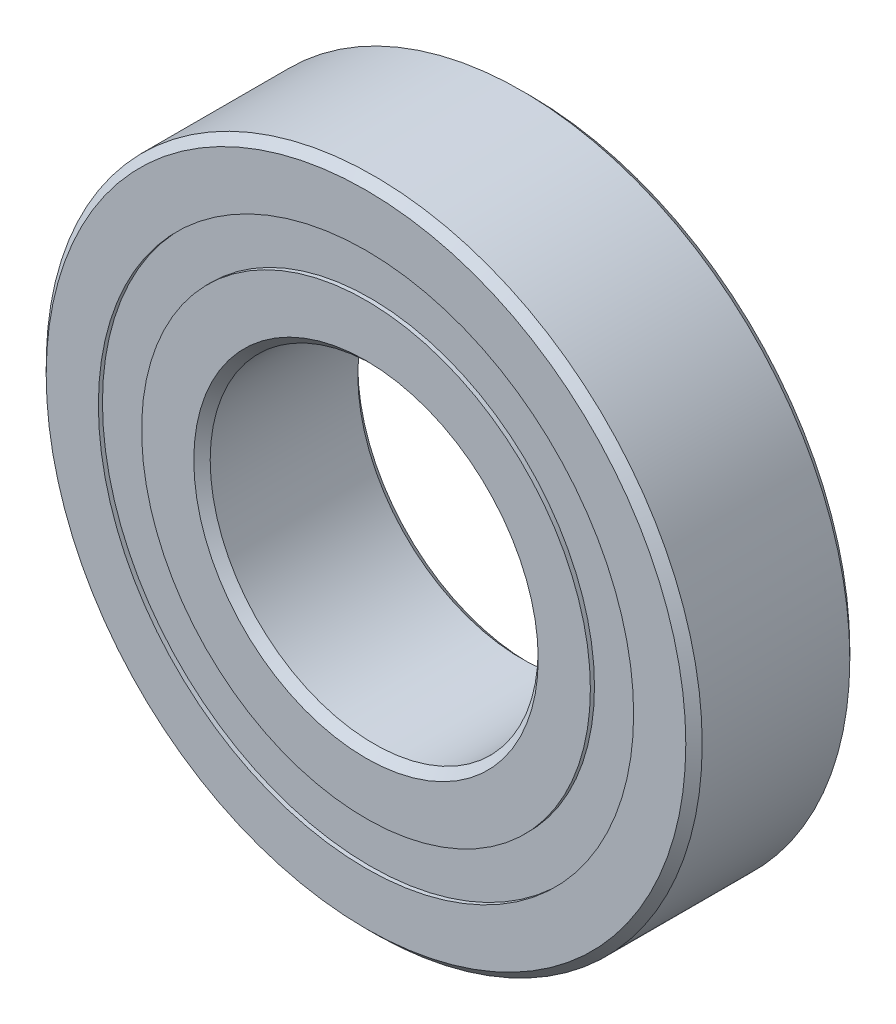
ISO-10303-21;
HEADER;
FILE_DESCRIPTION(('STEP AP214'),'2;1');
FILE_NAME('part.step','',(''),(''),'','','');
FILE_SCHEMA(('AUTOMOTIVE_DESIGN { 1 0 10303 214 1 1 1 1 }'));
ENDSEC;
DATA;
#1=APPLICATION_CONTEXT('core data for automotive mechanical design processes');
#2=APPLICATION_PROTOCOL_DEFINITION('international standard','automotive_design',2000,#1);
#3=PRODUCT_CONTEXT('',#1,'mechanical');
#4=PRODUCT('Part','Part','',(#3));
#5=PRODUCT_RELATED_PRODUCT_CATEGORY('part','',(#4));
#6=PRODUCT_DEFINITION_FORMATION('','',#4);
#7=PRODUCT_DEFINITION_CONTEXT('part definition',#1,'design');
#8=PRODUCT_DEFINITION('design','',#6,#7);
#9=PRODUCT_DEFINITION_SHAPE('','',#8);
#10=(LENGTH_UNIT() NAMED_UNIT(*) SI_UNIT(.MILLI.,.METRE.));
#11=(NAMED_UNIT(*) PLANE_ANGLE_UNIT() SI_UNIT($,.RADIAN.));
#12=(NAMED_UNIT(*) SI_UNIT($,.STERADIAN.) SOLID_ANGLE_UNIT());
#13=UNCERTAINTY_MEASURE_WITH_UNIT(LENGTH_MEASURE(1.E-05),#10,'distance_accuracy_value','');
#14=(GEOMETRIC_REPRESENTATION_CONTEXT(3) GLOBAL_UNCERTAINTY_ASSIGNED_CONTEXT((#13)) GLOBAL_UNIT_ASSIGNED_CONTEXT((#10,
#11,#12)) REPRESENTATION_CONTEXT('',''));
#15=CARTESIAN_POINT('',(0.,0.,0.));
#16=DIRECTION('',(0.,0.,1.));
#17=DIRECTION('',(1.,0.,0.));
#18=AXIS2_PLACEMENT_3D('',#15,#16,#17);
#19=CARTESIAN_POINT('',(0.,20.7247252747253,-6.0325));
#20=DIRECTION('',(0.,0.,1.));
#21=DIRECTION('',(1.,0.,0.));
#22=AXIS2_PLACEMENT_3D('',#19,#20,#21);
#23=PLANE('',#22);
#24=CARTESIAN_POINT('',(0.,0.,-6.0325));
#25=DIRECTION('',(0.,0.,1.));
#26=DIRECTION('',(1.,0.,0.));
#27=AXIS2_PLACEMENT_3D('',#24,#25,#26);
#28=CIRCLE('',#27,20.7247252747253);
#29=CARTESIAN_POINT('',(20.7247252747253,0.,-6.0325));
#30=VERTEX_POINT('',#29);
#31=EDGE_CURVE('E58',#30,#30,#28,.T.);
#32=ORIENTED_EDGE('',*,*,#31,.F.);
#33=EDGE_LOOP('',(#32));
#34=FACE_BOUND('',#33,.T.);
#35=CARTESIAN_POINT('',(0.,0.,-6.0325));
#36=DIRECTION('',(0.,0.,1.));
#37=DIRECTION('',(1.,0.,0.));
#38=AXIS2_PLACEMENT_3D('',#35,#36,#37);
#39=CIRCLE('',#38,17.3752747252747);
#40=CARTESIAN_POINT('',(17.3752747252747,0.,-6.0325));
#41=VERTEX_POINT('',#40);
#42=EDGE_CURVE('E11',#41,#41,#39,.T.);
#43=ORIENTED_EDGE('',*,*,#42,.T.);
#44=EDGE_LOOP('',(#43));
#45=FACE_BOUND('',#44,.T.);
#46=ADVANCED_FACE('F44',(#34,#45),#23,.F.);
#47=CARTESIAN_POINT('',(0.,0.,6.35));
#48=DIRECTION('',(0.,0.,1.));
#49=DIRECTION('',(1.,0.,0.));
#50=AXIS2_PLACEMENT_3D('',#47,#48,#49);
#51=CYLINDRICAL_SURFACE('',#50,17.3752747252747);
#52=ORIENTED_EDGE('',*,*,#42,.F.);
#53=EDGE_LOOP('',(#52));
#54=FACE_BOUND('',#53,.T.);
#55=CARTESIAN_POINT('',(0.,0.,-3.28171342706955));
#56=DIRECTION('',(0.,0.,1.));
#57=DIRECTION('',(1.,0.,0.));
#58=AXIS2_PLACEMENT_3D('',#55,#56,#57);
#59=CIRCLE('',#58,17.3752747252747);
#60=CARTESIAN_POINT('',(17.3752747252747,0.,-3.28171342706955));
#61=VERTEX_POINT('',#60);
#62=EDGE_CURVE('E50',#61,#61,#59,.T.);
#63=ORIENTED_EDGE('',*,*,#62,.T.);
#64=EDGE_LOOP('',(#63));
#65=FACE_BOUND('',#64,.T.);
#66=ADVANCED_FACE('F67',(#54,#65),#51,.F.);
#67=CARTESIAN_POINT('',(0.,20.7247252747253,-3.28171342706955));
#68=DIRECTION('',(0.,0.,-1.));
#69=DIRECTION('',(-1.,0.,0.));
#70=AXIS2_PLACEMENT_3D('',#67,#68,#69);
#71=PLANE('',#70);
#72=ORIENTED_EDGE('',*,*,#62,.F.);
#73=EDGE_LOOP('',(#72));
#74=FACE_BOUND('',#73,.T.);
#75=CARTESIAN_POINT('',(0.,0.,-3.28171342706955));
#76=DIRECTION('',(0.,0.,1.));
#77=DIRECTION('',(1.,0.,0.));
#78=AXIS2_PLACEMENT_3D('',#75,#76,#77);
#79=CIRCLE('',#78,20.7247252747253);
#80=CARTESIAN_POINT('',(20.7247252747253,0.,-3.28171342706955));
#81=VERTEX_POINT('',#80);
#82=EDGE_CURVE('E54',#81,#81,#79,.T.);
#83=ORIENTED_EDGE('',*,*,#82,.T.);
#84=EDGE_LOOP('',(#83));
#85=FACE_BOUND('',#84,.T.);
#86=ADVANCED_FACE('F71',(#74,#85),#71,.F.);
#87=CARTESIAN_POINT('',(0.,0.,6.35));
#88=DIRECTION('',(0.,0.,1.));
#89=DIRECTION('',(1.,0.,0.));
#90=AXIS2_PLACEMENT_3D('',#87,#88,#89);
#91=CYLINDRICAL_SURFACE('',#90,20.7247252747253);
#92=ORIENTED_EDGE('',*,*,#82,.F.);
#93=EDGE_LOOP('',(#92));
#94=FACE_BOUND('',#93,.T.);
#95=ORIENTED_EDGE('',*,*,#31,.T.);
#96=EDGE_LOOP('',(#95));
#97=FACE_BOUND('',#96,.T.);
#98=ADVANCED_FACE('F64',(#94,#97),#91,.T.);
#99=CLOSED_SHELL('',(#46,#66,#86,#98));
#100=MANIFOLD_SOLID_BREP('B2',#99);
#101=CARTESIAN_POINT('',(0.,20.7247252747253,6.0325));
#102=DIRECTION('',(0.,0.,-1.));
#103=DIRECTION('',(-1.,0.,0.));
#104=AXIS2_PLACEMENT_3D('',#101,#102,#103);
#105=PLANE('',#104);
#106=CARTESIAN_POINT('',(0.,0.,6.0325));
#107=DIRECTION('',(0.,0.,1.));
#108=DIRECTION('',(1.,0.,0.));
#109=AXIS2_PLACEMENT_3D('',#106,#107,#108);
#110=CIRCLE('',#109,17.3752747252747);
#111=CARTESIAN_POINT('',(17.3752747252747,0.,6.0325));
#112=VERTEX_POINT('',#111);
#113=EDGE_CURVE('E43',#112,#112,#110,.T.);
#114=ORIENTED_EDGE('',*,*,#113,.F.);
#115=EDGE_LOOP('',(#114));
#116=FACE_BOUND('',#115,.T.);
#117=CARTESIAN_POINT('',(0.,0.,6.0325));
#118=DIRECTION('',(0.,0.,1.));
#119=DIRECTION('',(1.,0.,0.));
#120=AXIS2_PLACEMENT_3D('',#117,#118,#119);
#121=CIRCLE('',#120,20.7247252747253);
#122=CARTESIAN_POINT('',(20.7247252747253,0.,6.0325));
#123=VERTEX_POINT('',#122);
#124=EDGE_CURVE('E126',#123,#123,#121,.T.);
#125=ORIENTED_EDGE('',*,*,#124,.T.);
#126=EDGE_LOOP('',(#125));
#127=FACE_BOUND('',#126,.T.);
#128=ADVANCED_FACE('F112',(#116,#127),#105,.F.);
#129=CARTESIAN_POINT('',(0.,0.,6.35));
#130=DIRECTION('',(0.,0.,1.));
#131=DIRECTION('',(1.,0.,0.));
#132=AXIS2_PLACEMENT_3D('',#129,#130,#131);
#133=CYLINDRICAL_SURFACE('',#132,17.3752747252747);
#134=CARTESIAN_POINT('',(0.,0.,3.28171342706955));
#135=DIRECTION('',(0.,0.,1.));
#136=DIRECTION('',(1.,0.,0.));
#137=AXIS2_PLACEMENT_3D('',#134,#135,#136);
#138=CIRCLE('',#137,17.3752747252747);
#139=CARTESIAN_POINT('',(17.3752747252747,0.,3.28171342706955));
#140=VERTEX_POINT('',#139);
#141=EDGE_CURVE('E118',#140,#140,#138,.T.);
#142=ORIENTED_EDGE('',*,*,#141,.F.);
#143=EDGE_LOOP('',(#142));
#144=FACE_BOUND('',#143,.T.);
#145=ORIENTED_EDGE('',*,*,#113,.T.);
#146=EDGE_LOOP('',(#145));
#147=FACE_BOUND('',#146,.T.);
#148=ADVANCED_FACE('F141',(#144,#147),#133,.F.);
#149=CARTESIAN_POINT('',(0.,20.7247252747253,3.28171342706955));
#150=DIRECTION('',(0.,0.,1.));
#151=DIRECTION('',(1.,0.,0.));
#152=AXIS2_PLACEMENT_3D('',#149,#150,#151);
#153=PLANE('',#152);
#154=CARTESIAN_POINT('',(0.,0.,3.28171342706955));
#155=DIRECTION('',(0.,0.,1.));
#156=DIRECTION('',(1.,0.,0.));
#157=AXIS2_PLACEMENT_3D('',#154,#155,#156);
#158=CIRCLE('',#157,20.7247252747253);
#159=CARTESIAN_POINT('',(20.7247252747253,0.,3.28171342706955));
#160=VERTEX_POINT('',#159);
#161=EDGE_CURVE('E122',#160,#160,#158,.T.);
#162=ORIENTED_EDGE('',*,*,#161,.F.);
#163=EDGE_LOOP('',(#162));
#164=FACE_BOUND('',#163,.T.);
#165=ORIENTED_EDGE('',*,*,#141,.T.);
#166=EDGE_LOOP('',(#165));
#167=FACE_BOUND('',#166,.T.);
#168=ADVANCED_FACE('F136',(#164,#167),#153,.F.);
#169=CARTESIAN_POINT('',(0.,0.,6.35));
#170=DIRECTION('',(0.,0.,1.));
#171=DIRECTION('',(1.,0.,0.));
#172=AXIS2_PLACEMENT_3D('',#169,#170,#171);
#173=CYLINDRICAL_SURFACE('',#172,20.7247252747253);
#174=ORIENTED_EDGE('',*,*,#124,.F.);
#175=EDGE_LOOP('',(#174));
#176=FACE_BOUND('',#175,.T.);
#177=ORIENTED_EDGE('',*,*,#161,.T.);
#178=EDGE_LOOP('',(#177));
#179=FACE_BOUND('',#178,.T.);
#180=ADVANCED_FACE('F133',(#176,#179),#173,.T.);
#181=CLOSED_SHELL('',(#128,#148,#168,#180));
#182=MANIFOLD_SOLID_BREP('B6',#181);
#183=CARTESIAN_POINT('',(-9.52499999999979,16.4977839420937,0.));
#184=DIRECTION('',(0.,0.,1.));
#185=DIRECTION('',(-0.499999999999989,0.866025403784445,0.));
#186=AXIS2_PLACEMENT_3D('',#183,#184,#185);
#187=SPHERICAL_SURFACE('',#186,3.28171342706955);
#188=CARTESIAN_POINT('',(-9.52499999999979,16.4977839420937,3.28171342706955));
#189=VERTEX_POINT('',#188);
#190=VERTEX_LOOP('',#189);
#191=FACE_BOUND('',#190,.T.);
#192=ADVANCED_FACE('F180',(#191),#187,.T.);
#193=CLOSED_SHELL('',(#192));
#194=MANIFOLD_SOLID_BREP('B38',#193);
#195=CARTESIAN_POINT('',(-16.4977839420934,9.52500000000019,0.));
#196=DIRECTION('',(0.,0.,1.));
#197=DIRECTION('',(-0.866025403784433,0.50000000000001,0.));
#198=AXIS2_PLACEMENT_3D('',#195,#196,#197);
#199=SPHERICAL_SURFACE('',#198,3.28171342706955);
#200=CARTESIAN_POINT('',(-16.4977839420934,9.52500000000019,3.28171342706955));
#201=VERTEX_POINT('',#200);
#202=VERTEX_LOOP('',#201);
#203=FACE_BOUND('',#202,.T.);
#204=ADVANCED_FACE('F201',(#203),#199,.T.);
#205=CLOSED_SHELL('',(#204));
#206=MANIFOLD_SOLID_BREP('B108',#205);
#207=CARTESIAN_POINT('',(-19.05,1.99538158514885E-13,0.));
#208=DIRECTION('',(0.,0.,1.));
#209=DIRECTION('',(-1.,0.,0.));
#210=AXIS2_PLACEMENT_3D('',#207,#208,#209);
#211=SPHERICAL_SURFACE('',#210,3.28171342706955);
#212=CARTESIAN_POINT('',(-19.05,1.99538158514885E-13,3.28171342706955));
#213=VERTEX_POINT('',#212);
#214=VERTEX_LOOP('',#213);
#215=FACE_BOUND('',#214,.T.);
#216=ADVANCED_FACE('F222',(#215),#211,.T.);
#217=CLOSED_SHELL('',(#216));
#218=MANIFOLD_SOLID_BREP('B176',#217);
#219=CARTESIAN_POINT('',(-16.4977839420936,-9.52499999999985,0.));
#220=DIRECTION('',(0.,0.,1.));
#221=DIRECTION('',(-0.866025403784443,-0.499999999999992,0.));
#222=AXIS2_PLACEMENT_3D('',#219,#220,#221);
#223=SPHERICAL_SURFACE('',#222,3.28171342706955);
#224=CARTESIAN_POINT('',(-16.4977839420936,-9.52499999999985,3.28171342706955));
#225=VERTEX_POINT('',#224);
#226=VERTEX_LOOP('',#225);
#227=FACE_BOUND('',#226,.T.);
#228=ADVANCED_FACE('F243',(#227),#223,.T.);
#229=CLOSED_SHELL('',(#228));
#230=MANIFOLD_SOLID_BREP('B197',#229);
#231=CARTESIAN_POINT('',(-9.52500000000013,-16.4977839420935,0.));
#232=DIRECTION('',(0.,0.,1.));
#233=DIRECTION('',(-0.500000000000007,-0.866025403784435,0.));
#234=AXIS2_PLACEMENT_3D('',#231,#232,#233);
#235=SPHERICAL_SURFACE('',#234,3.28171342706955);
#236=CARTESIAN_POINT('',(-9.52500000000013,-16.4977839420935,3.28171342706955));
#237=VERTEX_POINT('',#236);
#238=VERTEX_LOOP('',#237);
#239=FACE_BOUND('',#238,.T.);
#240=ADVANCED_FACE('F264',(#239),#235,.T.);
#241=CLOSED_SHELL('',(#240));
#242=MANIFOLD_SOLID_BREP('B218',#241);
#243=CARTESIAN_POINT('',(-1.33025439009923E-13,-19.05,0.));
#244=DIRECTION('',(0.,0.,1.));
#245=DIRECTION('',(0.,-1.,0.));
#246=AXIS2_PLACEMENT_3D('',#243,#244,#245);
#247=SPHERICAL_SURFACE('',#246,3.28171342706955);
#248=CARTESIAN_POINT('',(-1.33025439009923E-13,-19.05,3.28171342706955));
#249=VERTEX_POINT('',#248);
#250=VERTEX_LOOP('',#249);
#251=FACE_BOUND('',#250,.T.);
#252=ADVANCED_FACE('F285',(#251),#247,.T.);
#253=CLOSED_SHELL('',(#252));
#254=MANIFOLD_SOLID_BREP('B239',#253);
#255=CARTESIAN_POINT('',(9.5249999999999,-16.4977839420936,0.));
#256=DIRECTION('',(0.,0.,1.));
#257=DIRECTION('',(0.499999999999995,-0.866025403784442,0.));
#258=AXIS2_PLACEMENT_3D('',#255,#256,#257);
#259=SPHERICAL_SURFACE('',#258,3.28171342706955);
#260=CARTESIAN_POINT('',(9.5249999999999,-16.4977839420936,3.28171342706955));
#261=VERTEX_POINT('',#260);
#262=VERTEX_LOOP('',#261);
#263=FACE_BOUND('',#262,.T.);
#264=ADVANCED_FACE('F306',(#263),#259,.T.);
#265=CLOSED_SHELL('',(#264));
#266=MANIFOLD_SOLID_BREP('B260',#265);
#267=CARTESIAN_POINT('',(16.4977839420935,-9.52500000000008,0.));
#268=DIRECTION('',(0.,0.,1.));
#269=DIRECTION('',(0.866025403784436,-0.500000000000004,0.));
#270=AXIS2_PLACEMENT_3D('',#267,#268,#269);
#271=SPHERICAL_SURFACE('',#270,3.28171342706955);
#272=CARTESIAN_POINT('',(16.4977839420935,-9.52500000000008,3.28171342706955));
#273=VERTEX_POINT('',#272);
#274=VERTEX_LOOP('',#273);
#275=FACE_BOUND('',#274,.T.);
#276=ADVANCED_FACE('F327',(#275),#271,.T.);
#277=CLOSED_SHELL('',(#276));
#278=MANIFOLD_SOLID_BREP('B281',#277);
#279=CARTESIAN_POINT('',(19.05,0.,0.));
#280=DIRECTION('',(0.,0.,1.));
#281=DIRECTION('',(1.,0.,0.));
#282=AXIS2_PLACEMENT_3D('',#279,#280,#281);
#283=SPHERICAL_SURFACE('',#282,3.28171342706955);
#284=CARTESIAN_POINT('',(19.05,0.,3.28171342706955));
#285=VERTEX_POINT('',#284);
#286=VERTEX_LOOP('',#285);
#287=FACE_BOUND('',#286,.T.);
#288=ADVANCED_FACE('F348',(#287),#283,.T.);
#289=CLOSED_SHELL('',(#288));
#290=MANIFOLD_SOLID_BREP('B302',#289);
#291=CARTESIAN_POINT('',(16.4977839420936,9.52499999999996,0.));
#292=DIRECTION('',(0.,0.,1.));
#293=DIRECTION('',(0.86602540378444,0.499999999999998,0.));
#294=AXIS2_PLACEMENT_3D('',#291,#292,#293);
#295=SPHERICAL_SURFACE('',#294,3.28171342706955);
#296=CARTESIAN_POINT('',(16.4977839420936,9.52499999999996,3.28171342706955));
#297=VERTEX_POINT('',#296);
#298=VERTEX_LOOP('',#297);
#299=FACE_BOUND('',#298,.T.);
#300=ADVANCED_FACE('F369',(#299),#295,.T.);
#301=CLOSED_SHELL('',(#300));
#302=MANIFOLD_SOLID_BREP('B323',#301);
#303=CARTESIAN_POINT('',(9.52500000000002,16.4977839420935,0.));
#304=DIRECTION('',(0.,0.,1.));
#305=DIRECTION('',(0.500000000000001,0.866025403784438,0.));
#306=AXIS2_PLACEMENT_3D('',#303,#304,#305);
#307=SPHERICAL_SURFACE('',#306,3.28171342706955);
#308=CARTESIAN_POINT('',(9.52500000000002,16.4977839420935,3.28171342706955));
#309=VERTEX_POINT('',#308);
#310=VERTEX_LOOP('',#309);
#311=FACE_BOUND('',#310,.T.);
#312=ADVANCED_FACE('F390',(#311),#307,.T.);
#313=CLOSED_SHELL('',(#312));
#314=MANIFOLD_SOLID_BREP('B344',#313);
#315=CARTESIAN_POINT('',(0.,19.05,0.));
#316=DIRECTION('',(0.,0.,1.));
#317=DIRECTION('',(0.,1.,0.));
#318=AXIS2_PLACEMENT_3D('',#315,#316,#317);
#319=SPHERICAL_SURFACE('',#318,3.28171342706955);
#320=CARTESIAN_POINT('',(0.,19.05,3.28171342706955));
#321=VERTEX_POINT('',#320);
#322=VERTEX_LOOP('',#321);
#323=FACE_BOUND('',#322,.T.);
#324=ADVANCED_FACE('F413',(#323),#319,.T.);
#325=CLOSED_SHELL('',(#324));
#326=MANIFOLD_SOLID_BREP('B365',#325);
#327=CARTESIAN_POINT('',(0.,17.3752747252747,6.35));
#328=DIRECTION('',(0.,0.,-1.));
#329=DIRECTION('',(-1.,0.,0.));
#330=AXIS2_PLACEMENT_3D('',#327,#328,#329);
#331=PLANE('',#330);
#332=CARTESIAN_POINT('',(0.,0.,6.35));
#333=DIRECTION('',(0.,0.,1.));
#334=DIRECTION('',(1.,0.,0.));
#335=AXIS2_PLACEMENT_3D('',#332,#333,#334);
#336=CIRCLE('',#335,13.335);
#337=CARTESIAN_POINT('',(13.335,0.,6.35));
#338=VERTEX_POINT('',#337);
#339=EDGE_CURVE('E461',#338,#338,#336,.T.);
#340=ORIENTED_EDGE('',*,*,#339,.F.);
#341=EDGE_LOOP('',(#340));
#342=FACE_BOUND('',#341,.T.);
#343=CARTESIAN_POINT('',(0.,0.,6.35));
#344=DIRECTION('',(0.,0.,1.));
#345=DIRECTION('',(1.,0.,0.));
#346=AXIS2_PLACEMENT_3D('',#343,#344,#345);
#347=CIRCLE('',#346,17.3752747252747);
#348=CARTESIAN_POINT('',(17.3752747252747,0.,6.35));
#349=VERTEX_POINT('',#348);
#350=EDGE_CURVE('E412',#349,#349,#347,.T.);
#351=ORIENTED_EDGE('',*,*,#350,.T.);
#352=EDGE_LOOP('',(#351));
#353=FACE_BOUND('',#352,.T.);
#354=ADVANCED_FACE('F433',(#342,#353),#331,.F.);
#355=CARTESIAN_POINT('',(0.,0.,6.35));
#356=DIRECTION('',(0.,0.,1.));
#357=DIRECTION('',(1.,0.,0.));
#358=AXIS2_PLACEMENT_3D('',#355,#356,#357);
#359=CYLINDRICAL_SURFACE('',#358,17.3752747252747);
#360=ORIENTED_EDGE('',*,*,#350,.F.);
#361=EDGE_LOOP('',(#360));
#362=FACE_BOUND('',#361,.T.);
#363=CARTESIAN_POINT('',(0.,0.,2.82222222222222));
#364=DIRECTION('',(0.,0.,1.));
#365=DIRECTION('',(1.,0.,0.));
#366=AXIS2_PLACEMENT_3D('',#363,#364,#365);
#367=CIRCLE('',#366,17.3752747252747);
#368=CARTESIAN_POINT('',(17.3752747252747,0.,2.82222222222222));
#369=VERTEX_POINT('',#368);
#370=EDGE_CURVE('E439',#369,#369,#367,.T.);
#371=ORIENTED_EDGE('',*,*,#370,.T.);
#372=EDGE_LOOP('',(#371));
#373=FACE_BOUND('',#372,.T.);
#374=ADVANCED_FACE('F468',(#362,#373),#359,.T.);
#375=CARTESIAN_POINT('',(0.,0.,0.));
#376=DIRECTION('',(0.,0.,1.));
#377=DIRECTION('',(1.,0.,0.));
#378=AXIS2_PLACEMENT_3D('',#375,#376,#377);
#379=TOROIDAL_SURFACE('',#378,19.05,3.28171342706955);
#380=ORIENTED_EDGE('',*,*,#370,.F.);
#381=EDGE_LOOP('',(#380));
#382=FACE_BOUND('',#381,.T.);
#383=CARTESIAN_POINT('',(0.,0.,-2.82222222222223));
#384=DIRECTION('',(0.,0.,1.));
#385=DIRECTION('',(1.,0.,0.));
#386=AXIS2_PLACEMENT_3D('',#383,#384,#385);
#387=CIRCLE('',#386,17.3752747252747);
#388=CARTESIAN_POINT('',(17.3752747252747,0.,-2.82222222222223));
#389=VERTEX_POINT('',#388);
#390=EDGE_CURVE('E443',#389,#389,#387,.T.);
#391=ORIENTED_EDGE('',*,*,#390,.T.);
#392=EDGE_LOOP('',(#391));
#393=FACE_BOUND('',#392,.T.);
#394=ADVANCED_FACE('F472',(#382,#393),#379,.F.);
#395=CARTESIAN_POINT('',(0.,0.,6.35));
#396=DIRECTION('',(0.,0.,1.));
#397=DIRECTION('',(1.,0.,0.));
#398=AXIS2_PLACEMENT_3D('',#395,#396,#397);
#399=CYLINDRICAL_SURFACE('',#398,17.3752747252747);
#400=ORIENTED_EDGE('',*,*,#390,.F.);
#401=EDGE_LOOP('',(#400));
#402=FACE_BOUND('',#401,.T.);
#403=CARTESIAN_POINT('',(0.,0.,-6.35));
#404=DIRECTION('',(0.,0.,1.));
#405=DIRECTION('',(1.,0.,0.));
#406=AXIS2_PLACEMENT_3D('',#403,#404,#405);
#407=CIRCLE('',#406,17.3752747252747);
#408=CARTESIAN_POINT('',(17.3752747252747,0.,-6.35));
#409=VERTEX_POINT('',#408);
#410=EDGE_CURVE('E447',#409,#409,#407,.T.);
#411=ORIENTED_EDGE('',*,*,#410,.T.);
#412=EDGE_LOOP('',(#411));
#413=FACE_BOUND('',#412,.T.);
#414=ADVANCED_FACE('F477',(#402,#413),#399,.T.);
#415=CARTESIAN_POINT('',(0.,13.335,-6.35));
#416=DIRECTION('',(0.,0.,1.));
#417=DIRECTION('',(1.,0.,0.));
#418=AXIS2_PLACEMENT_3D('',#415,#416,#417);
#419=PLANE('',#418);
#420=ORIENTED_EDGE('',*,*,#410,.F.);
#421=EDGE_LOOP('',(#420));
#422=FACE_BOUND('',#421,.T.);
#423=CARTESIAN_POINT('',(0.,0.,-6.35));
#424=DIRECTION('',(0.,0.,1.));
#425=DIRECTION('',(1.,0.,0.));
#426=AXIS2_PLACEMENT_3D('',#423,#424,#425);
#427=CIRCLE('',#426,13.335);
#428=CARTESIAN_POINT('',(13.335,0.,-6.35));
#429=VERTEX_POINT('',#428);
#430=EDGE_CURVE('E452',#429,#429,#427,.T.);
#431=ORIENTED_EDGE('',*,*,#430,.T.);
#432=EDGE_LOOP('',(#431));
#433=FACE_BOUND('',#432,.T.);
#434=ADVANCED_FACE('F483',(#422,#433),#419,.F.);
#435=CARTESIAN_POINT('',(0.,0.,-5.715));
#436=DIRECTION('',(0.,0.,-1.));
#437=DIRECTION('',(-1.,0.,0.));
#438=AXIS2_PLACEMENT_3D('',#435,#436,#437);
#439=CONICAL_SURFACE('',#438,12.7,0.785398163397446);
#440=ORIENTED_EDGE('',*,*,#430,.F.);
#441=EDGE_LOOP('',(#440));
#442=FACE_BOUND('',#441,.T.);
#443=CARTESIAN_POINT('',(0.,0.,-5.715));
#444=DIRECTION('',(0.,0.,1.));
#445=DIRECTION('',(1.,0.,0.));
#446=AXIS2_PLACEMENT_3D('',#443,#444,#445);
#447=CIRCLE('',#446,12.7);
#448=CARTESIAN_POINT('',(12.7,0.,-5.715));
#449=VERTEX_POINT('',#448);
#450=EDGE_CURVE('E455',#449,#449,#447,.T.);
#451=ORIENTED_EDGE('',*,*,#450,.T.);
#452=EDGE_LOOP('',(#451));
#453=FACE_BOUND('',#452,.T.);
#454=ADVANCED_FACE('F487',(#442,#453),#439,.F.);
#455=CARTESIAN_POINT('',(0.,0.,6.35));
#456=DIRECTION('',(0.,0.,1.));
#457=DIRECTION('',(1.,0.,0.));
#458=AXIS2_PLACEMENT_3D('',#455,#456,#457);
#459=CYLINDRICAL_SURFACE('',#458,12.7);
#460=ORIENTED_EDGE('',*,*,#450,.F.);
#461=EDGE_LOOP('',(#460));
#462=FACE_BOUND('',#461,.T.);
#463=CARTESIAN_POINT('',(0.,0.,5.71500000000001));
#464=DIRECTION('',(0.,0.,1.));
#465=DIRECTION('',(1.,0.,0.));
#466=AXIS2_PLACEMENT_3D('',#463,#464,#465);
#467=CIRCLE('',#466,12.7);
#468=CARTESIAN_POINT('',(12.7,0.,5.71500000000001));
#469=VERTEX_POINT('',#468);
#470=EDGE_CURVE('E458',#469,#469,#467,.T.);
#471=ORIENTED_EDGE('',*,*,#470,.T.);
#472=EDGE_LOOP('',(#471));
#473=FACE_BOUND('',#472,.T.);
#474=ADVANCED_FACE('F491',(#462,#473),#459,.F.);
#475=CARTESIAN_POINT('',(0.,0.,6.35));
#476=DIRECTION('',(0.,0.,1.));
#477=DIRECTION('',(1.,0.,0.));
#478=AXIS2_PLACEMENT_3D('',#475,#476,#477);
#479=CONICAL_SURFACE('',#478,13.335,0.78539816339745);
#480=ORIENTED_EDGE('',*,*,#470,.F.);
#481=EDGE_LOOP('',(#480));
#482=FACE_BOUND('',#481,.T.);
#483=ORIENTED_EDGE('',*,*,#339,.T.);
#484=EDGE_LOOP('',(#483));
#485=FACE_BOUND('',#484,.T.);
#486=ADVANCED_FACE('F465',(#482,#485),#479,.F.);
#487=CLOSED_SHELL('',(#354,#374,#394,#414,#434,#454,#474,#486));
#488=MANIFOLD_SOLID_BREP('B386',#487);
#489=CARTESIAN_POINT('',(0.,0.,5.715));
#490=DIRECTION('',(0.,0.,-1.));
#491=DIRECTION('',(-1.,0.,0.));
#492=AXIS2_PLACEMENT_3D('',#489,#490,#491);
#493=CONICAL_SURFACE('',#492,25.4,0.785398163397446);
#494=CARTESIAN_POINT('',(0.,0.,6.35));
#495=DIRECTION('',(0.,0.,1.));
#496=DIRECTION('',(1.,0.,0.));
#497=AXIS2_PLACEMENT_3D('',#494,#495,#496);
#498=CIRCLE('',#497,24.765);
#499=CARTESIAN_POINT('',(24.765,0.,6.35));
#500=VERTEX_POINT('',#499);
#501=EDGE_CURVE('E583',#500,#500,#498,.T.);
#502=ORIENTED_EDGE('',*,*,#501,.F.);
#503=EDGE_LOOP('',(#502));
#504=FACE_BOUND('',#503,.T.);
#505=CARTESIAN_POINT('',(0.,0.,5.715));
#506=DIRECTION('',(0.,0.,1.));
#507=DIRECTION('',(1.,0.,0.));
#508=AXIS2_PLACEMENT_3D('',#505,#506,#507);
#509=CIRCLE('',#508,25.4);
#510=CARTESIAN_POINT('',(25.4,0.,5.715));
#511=VERTEX_POINT('',#510);
#512=EDGE_CURVE('E432',#511,#511,#509,.T.);
#513=ORIENTED_EDGE('',*,*,#512,.T.);
#514=EDGE_LOOP('',(#513));
#515=FACE_BOUND('',#514,.T.);
#516=ADVANCED_FACE('F555',(#504,#515),#493,.T.);
#517=CARTESIAN_POINT('',(0.,0.,6.35));
#518=DIRECTION('',(0.,0.,1.));
#519=DIRECTION('',(1.,0.,0.));
#520=AXIS2_PLACEMENT_3D('',#517,#518,#519);
#521=CYLINDRICAL_SURFACE('',#520,25.4);
#522=ORIENTED_EDGE('',*,*,#512,.F.);
#523=EDGE_LOOP('',(#522));
#524=FACE_BOUND('',#523,.T.);
#525=CARTESIAN_POINT('',(0.,0.,-5.715));
#526=DIRECTION('',(0.,0.,1.));
#527=DIRECTION('',(1.,0.,0.));
#528=AXIS2_PLACEMENT_3D('',#525,#526,#527);
#529=CIRCLE('',#528,25.4);
#530=CARTESIAN_POINT('',(25.4,0.,-5.715));
#531=VERTEX_POINT('',#530);
#532=EDGE_CURVE('E561',#531,#531,#529,.T.);
#533=ORIENTED_EDGE('',*,*,#532,.T.);
#534=EDGE_LOOP('',(#533));
#535=FACE_BOUND('',#534,.T.);
#536=ADVANCED_FACE('F590',(#524,#535),#521,.T.);
#537=CARTESIAN_POINT('',(0.,0.,-6.35));
#538=DIRECTION('',(0.,0.,1.));
#539=DIRECTION('',(1.,0.,0.));
#540=AXIS2_PLACEMENT_3D('',#537,#538,#539);
#541=CONICAL_SURFACE('',#540,24.765,0.785398163397446);
#542=ORIENTED_EDGE('',*,*,#532,.F.);
#543=EDGE_LOOP('',(#542));
#544=FACE_BOUND('',#543,.T.);
#545=CARTESIAN_POINT('',(0.,0.,-6.35));
#546=DIRECTION('',(0.,0.,1.));
#547=DIRECTION('',(1.,0.,0.));
#548=AXIS2_PLACEMENT_3D('',#545,#546,#547);
#549=CIRCLE('',#548,24.765);
#550=CARTESIAN_POINT('',(24.765,0.,-6.35));
#551=VERTEX_POINT('',#550);
#552=EDGE_CURVE('E565',#551,#551,#549,.T.);
#553=ORIENTED_EDGE('',*,*,#552,.T.);
#554=EDGE_LOOP('',(#553));
#555=FACE_BOUND('',#554,.T.);
#556=ADVANCED_FACE('F594',(#544,#555),#541,.T.);
#557=CARTESIAN_POINT('',(0.,24.765,-6.35));
#558=DIRECTION('',(0.,0.,1.));
#559=DIRECTION('',(1.,0.,0.));
#560=AXIS2_PLACEMENT_3D('',#557,#558,#559);
#561=PLANE('',#560);
#562=ORIENTED_EDGE('',*,*,#552,.F.);
#563=EDGE_LOOP('',(#562));
#564=FACE_BOUND('',#563,.T.);
#565=CARTESIAN_POINT('',(0.,0.,-6.35));
#566=DIRECTION('',(0.,0.,1.));
#567=DIRECTION('',(1.,0.,0.));
#568=AXIS2_PLACEMENT_3D('',#565,#566,#567);
#569=CIRCLE('',#568,20.7247252747253);
#570=CARTESIAN_POINT('',(20.7247252747253,0.,-6.35));
#571=VERTEX_POINT('',#570);
#572=EDGE_CURVE('E569',#571,#571,#569,.T.);
#573=ORIENTED_EDGE('',*,*,#572,.T.);
#574=EDGE_LOOP('',(#573));
#575=FACE_BOUND('',#574,.T.);
#576=ADVANCED_FACE('F599',(#564,#575),#561,.F.);
#577=CARTESIAN_POINT('',(0.,0.,6.35));
#578=DIRECTION('',(0.,0.,1.));
#579=DIRECTION('',(1.,0.,0.));
#580=AXIS2_PLACEMENT_3D('',#577,#578,#579);
#581=CYLINDRICAL_SURFACE('',#580,20.7247252747253);
#582=ORIENTED_EDGE('',*,*,#572,.F.);
#583=EDGE_LOOP('',(#582));
#584=FACE_BOUND('',#583,.T.);
#585=CARTESIAN_POINT('',(0.,0.,-2.82222222222222));
#586=DIRECTION('',(0.,0.,1.));
#587=DIRECTION('',(1.,0.,0.));
#588=AXIS2_PLACEMENT_3D('',#585,#586,#587);
#589=CIRCLE('',#588,20.7247252747253);
#590=CARTESIAN_POINT('',(20.7247252747253,0.,-2.82222222222222));
#591=VERTEX_POINT('',#590);
#592=EDGE_CURVE('E574',#591,#591,#589,.T.);
#593=ORIENTED_EDGE('',*,*,#592,.T.);
#594=EDGE_LOOP('',(#593));
#595=FACE_BOUND('',#594,.T.);
#596=ADVANCED_FACE('F605',(#584,#595),#581,.F.);
#597=CARTESIAN_POINT('',(0.,0.,0.));
#598=DIRECTION('',(0.,0.,1.));
#599=DIRECTION('',(1.,0.,0.));
#600=AXIS2_PLACEMENT_3D('',#597,#598,#599);
#601=TOROIDAL_SURFACE('',#600,19.05,3.28171342706955);
#602=ORIENTED_EDGE('',*,*,#592,.F.);
#603=EDGE_LOOP('',(#602));
#604=FACE_BOUND('',#603,.T.);
#605=CARTESIAN_POINT('',(0.,0.,2.82222222222222));
#606=DIRECTION('',(0.,0.,1.));
#607=DIRECTION('',(1.,0.,0.));
#608=AXIS2_PLACEMENT_3D('',#605,#606,#607);
#609=CIRCLE('',#608,20.7247252747253);
#610=CARTESIAN_POINT('',(20.7247252747253,0.,2.82222222222222));
#611=VERTEX_POINT('',#610);
#612=EDGE_CURVE('E577',#611,#611,#609,.T.);
#613=ORIENTED_EDGE('',*,*,#612,.T.);
#614=EDGE_LOOP('',(#613));
#615=FACE_BOUND('',#614,.T.);
#616=ADVANCED_FACE('F609',(#604,#615),#601,.F.);
#617=CARTESIAN_POINT('',(0.,0.,6.35));
#618=DIRECTION('',(0.,0.,1.));
#619=DIRECTION('',(1.,0.,0.));
#620=AXIS2_PLACEMENT_3D('',#617,#618,#619);
#621=CYLINDRICAL_SURFACE('',#620,20.7247252747253);
#622=ORIENTED_EDGE('',*,*,#612,.F.);
#623=EDGE_LOOP('',(#622));
#624=FACE_BOUND('',#623,.T.);
#625=CARTESIAN_POINT('',(0.,0.,6.35));
#626=DIRECTION('',(0.,0.,1.));
#627=DIRECTION('',(1.,0.,0.));
#628=AXIS2_PLACEMENT_3D('',#625,#626,#627);
#629=CIRCLE('',#628,20.7247252747253);
#630=CARTESIAN_POINT('',(20.7247252747253,0.,6.35));
#631=VERTEX_POINT('',#630);
#632=EDGE_CURVE('E580',#631,#631,#629,.T.);
#633=ORIENTED_EDGE('',*,*,#632,.T.);
#634=EDGE_LOOP('',(#633));
#635=FACE_BOUND('',#634,.T.);
#636=ADVANCED_FACE('F613',(#624,#635),#621,.F.);
#637=CARTESIAN_POINT('',(0.,24.765,6.35));
#638=DIRECTION('',(0.,0.,-1.));
#639=DIRECTION('',(-1.,0.,0.));
#640=AXIS2_PLACEMENT_3D('',#637,#638,#639);
#641=PLANE('',#640);
#642=ORIENTED_EDGE('',*,*,#632,.F.);
#643=EDGE_LOOP('',(#642));
#644=FACE_BOUND('',#643,.T.);
#645=ORIENTED_EDGE('',*,*,#501,.T.);
#646=EDGE_LOOP('',(#645));
#647=FACE_BOUND('',#646,.T.);
#648=ADVANCED_FACE('F587',(#644,#647),#641,.F.);
#649=CLOSED_SHELL('',(#516,#536,#556,#576,#596,#616,#636,#648));
#650=MANIFOLD_SOLID_BREP('B407',#649);
#651=ADVANCED_BREP_SHAPE_REPRESENTATION('',(#18,#100,#182,#194,#206,#218,#230,#242,#254,#266,
#278,#290,#302,#314,#326,#488,#650),#14);
#652=SHAPE_DEFINITION_REPRESENTATION(#9,#651);
ENDSEC;
END-ISO-10303-21;
